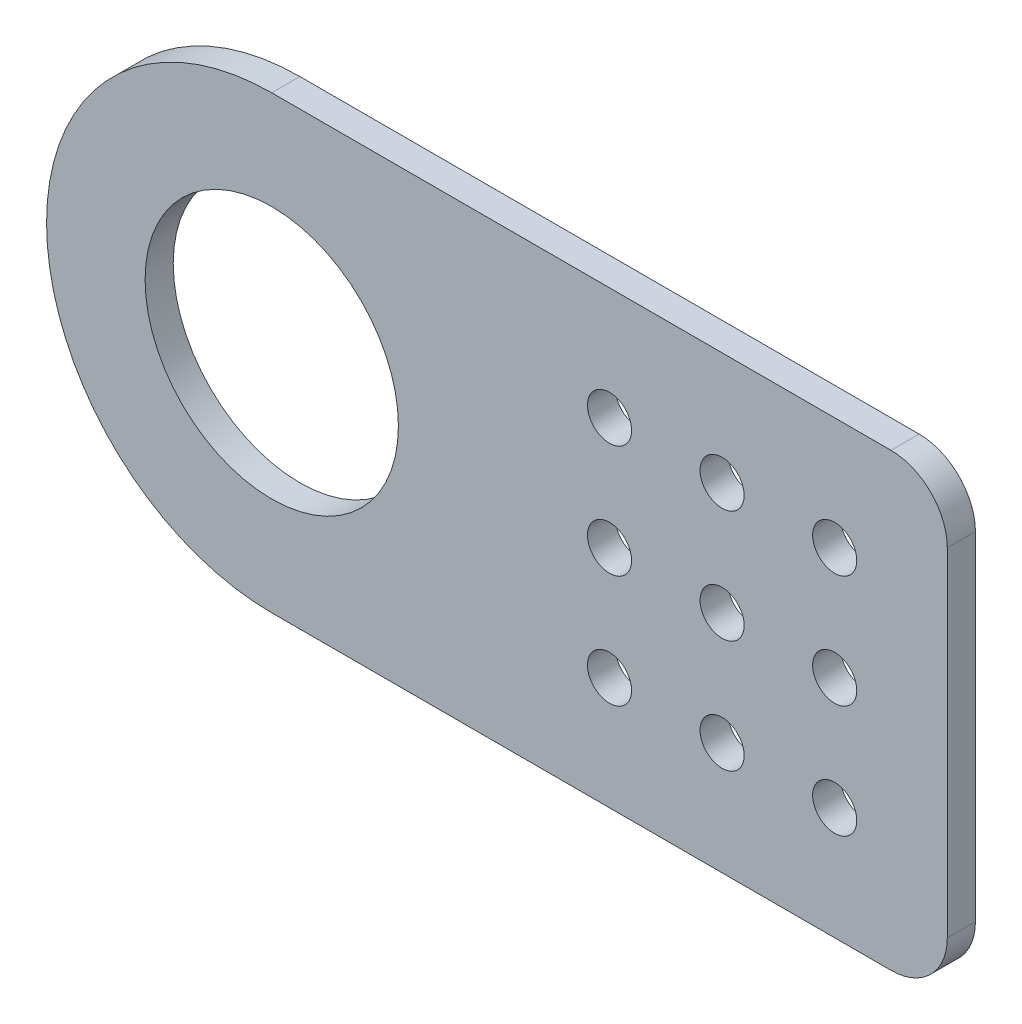
ISO-10303-21;
HEADER;
FILE_DESCRIPTION(('STEP AP214'),'2;1');
FILE_NAME('part.step','',(''),(''),'','','');
FILE_SCHEMA(('AUTOMOTIVE_DESIGN { 1 0 10303 214 1 1 1 1 }'));
ENDSEC;
DATA;
#1=APPLICATION_CONTEXT('core data for automotive mechanical design processes');
#2=APPLICATION_PROTOCOL_DEFINITION('international standard','automotive_design',2000,#1);
#3=PRODUCT_CONTEXT('',#1,'mechanical');
#4=PRODUCT('Part','Part','',(#3));
#5=PRODUCT_RELATED_PRODUCT_CATEGORY('part','',(#4));
#6=PRODUCT_DEFINITION_FORMATION('','',#4);
#7=PRODUCT_DEFINITION_CONTEXT('part definition',#1,'design');
#8=PRODUCT_DEFINITION('design','',#6,#7);
#9=PRODUCT_DEFINITION_SHAPE('','',#8);
#10=(LENGTH_UNIT() NAMED_UNIT(*) SI_UNIT(.MILLI.,.METRE.));
#11=(NAMED_UNIT(*) PLANE_ANGLE_UNIT() SI_UNIT($,.RADIAN.));
#12=(NAMED_UNIT(*) SI_UNIT($,.STERADIAN.) SOLID_ANGLE_UNIT());
#13=UNCERTAINTY_MEASURE_WITH_UNIT(LENGTH_MEASURE(1.E-05),#10,'distance_accuracy_value','');
#14=(GEOMETRIC_REPRESENTATION_CONTEXT(3) GLOBAL_UNCERTAINTY_ASSIGNED_CONTEXT((#13)) GLOBAL_UNIT_ASSIGNED_CONTEXT((#10,
#11,#12)) REPRESENTATION_CONTEXT('',''));
#15=CARTESIAN_POINT('',(0.,0.,0.));
#16=DIRECTION('',(0.,0.,1.));
#17=DIRECTION('',(1.,0.,0.));
#18=AXIS2_PLACEMENT_3D('',#15,#16,#17);
#19=CARTESIAN_POINT('',(0.,0.,0.));
#20=DIRECTION('',(0.,0.,1.));
#21=DIRECTION('',(1.,0.,0.));
#22=AXIS2_PLACEMENT_3D('',#19,#20,#21);
#23=PLANE('',#22);
#24=CARTESIAN_POINT('',(0.,0.,0.));
#25=DIRECTION('',(0.,0.,1.));
#26=DIRECTION('',(1.,0.,0.));
#27=AXIS2_PLACEMENT_3D('',#24,#25,#26);
#28=CIRCLE('',#27,14.2875);
#29=CARTESIAN_POINT('',(14.2875,0.,0.));
#30=VERTEX_POINT('',#29);
#31=EDGE_CURVE('E136',#30,#30,#28,.T.);
#32=ORIENTED_EDGE('',*,*,#31,.T.);
#33=EDGE_LOOP('',(#32));
#34=FACE_BOUND('',#33,.T.);
#35=CARTESIAN_POINT('',(63.5,-12.7,0.));
#36=DIRECTION('',(0.,0.,1.));
#37=DIRECTION('',(1.,0.,0.));
#38=AXIS2_PLACEMENT_3D('',#35,#36,#37);
#39=CIRCLE('',#38,2.4892);
#40=CARTESIAN_POINT('',(65.9892,-12.7,0.));
#41=VERTEX_POINT('',#40);
#42=EDGE_CURVE('E139',#41,#41,#39,.T.);
#43=ORIENTED_EDGE('',*,*,#42,.T.);
#44=EDGE_LOOP('',(#43));
#45=FACE_BOUND('',#44,.T.);
#46=CARTESIAN_POINT('',(38.1,-12.7,0.));
#47=DIRECTION('',(0.,0.,1.));
#48=DIRECTION('',(1.,0.,0.));
#49=AXIS2_PLACEMENT_3D('',#46,#47,#48);
#50=CIRCLE('',#49,2.4892);
#51=CARTESIAN_POINT('',(40.5892,-12.7,0.));
#52=VERTEX_POINT('',#51);
#53=EDGE_CURVE('E142',#52,#52,#50,.T.);
#54=ORIENTED_EDGE('',*,*,#53,.T.);
#55=EDGE_LOOP('',(#54));
#56=FACE_BOUND('',#55,.T.);
#57=CARTESIAN_POINT('',(50.8,0.,0.));
#58=DIRECTION('',(0.,0.,1.));
#59=DIRECTION('',(1.,0.,0.));
#60=AXIS2_PLACEMENT_3D('',#57,#58,#59);
#61=CIRCLE('',#60,2.4892);
#62=CARTESIAN_POINT('',(53.2892,0.,0.));
#63=VERTEX_POINT('',#62);
#64=EDGE_CURVE('E145',#63,#63,#61,.T.);
#65=ORIENTED_EDGE('',*,*,#64,.T.);
#66=EDGE_LOOP('',(#65));
#67=FACE_BOUND('',#66,.T.);
#68=CARTESIAN_POINT('',(63.5,12.7,0.));
#69=DIRECTION('',(0.,0.,1.));
#70=DIRECTION('',(1.,0.,0.));
#71=AXIS2_PLACEMENT_3D('',#68,#69,#70);
#72=CIRCLE('',#71,2.4892);
#73=CARTESIAN_POINT('',(65.9892,12.7,0.));
#74=VERTEX_POINT('',#73);
#75=EDGE_CURVE('E148',#74,#74,#72,.T.);
#76=ORIENTED_EDGE('',*,*,#75,.T.);
#77=EDGE_LOOP('',(#76));
#78=FACE_BOUND('',#77,.T.);
#79=CARTESIAN_POINT('',(38.1,12.7,0.));
#80=DIRECTION('',(0.,0.,1.));
#81=DIRECTION('',(1.,0.,0.));
#82=AXIS2_PLACEMENT_3D('',#79,#80,#81);
#83=CIRCLE('',#82,2.4892);
#84=CARTESIAN_POINT('',(40.5892,12.7,0.));
#85=VERTEX_POINT('',#84);
#86=EDGE_CURVE('E151',#85,#85,#83,.T.);
#87=ORIENTED_EDGE('',*,*,#86,.T.);
#88=EDGE_LOOP('',(#87));
#89=FACE_BOUND('',#88,.T.);
#90=CARTESIAN_POINT('',(50.8,12.7,0.));
#91=DIRECTION('',(0.,0.,1.));
#92=DIRECTION('',(1.,0.,0.));
#93=AXIS2_PLACEMENT_3D('',#90,#91,#92);
#94=CIRCLE('',#93,2.4892);
#95=CARTESIAN_POINT('',(53.2892,12.7,0.));
#96=VERTEX_POINT('',#95);
#97=EDGE_CURVE('E154',#96,#96,#94,.T.);
#98=ORIENTED_EDGE('',*,*,#97,.T.);
#99=EDGE_LOOP('',(#98));
#100=FACE_BOUND('',#99,.T.);
#101=CARTESIAN_POINT('',(63.5,0.,0.));
#102=DIRECTION('',(0.,0.,1.));
#103=DIRECTION('',(1.,0.,0.));
#104=AXIS2_PLACEMENT_3D('',#101,#102,#103);
#105=CIRCLE('',#104,2.4892);
#106=CARTESIAN_POINT('',(65.9892,0.,0.));
#107=VERTEX_POINT('',#106);
#108=EDGE_CURVE('E157',#107,#107,#105,.T.);
#109=ORIENTED_EDGE('',*,*,#108,.T.);
#110=EDGE_LOOP('',(#109));
#111=FACE_BOUND('',#110,.T.);
#112=CARTESIAN_POINT('',(38.1,0.,0.));
#113=DIRECTION('',(0.,0.,1.));
#114=DIRECTION('',(1.,0.,0.));
#115=AXIS2_PLACEMENT_3D('',#112,#113,#114);
#116=CIRCLE('',#115,2.4892);
#117=CARTESIAN_POINT('',(40.5892,0.,0.));
#118=VERTEX_POINT('',#117);
#119=EDGE_CURVE('E88',#118,#118,#116,.T.);
#120=ORIENTED_EDGE('',*,*,#119,.T.);
#121=EDGE_LOOP('',(#120));
#122=FACE_BOUND('',#121,.T.);
#123=CARTESIAN_POINT('',(50.8,-12.7,0.));
#124=DIRECTION('',(0.,0.,1.));
#125=DIRECTION('',(1.,0.,0.));
#126=AXIS2_PLACEMENT_3D('',#123,#124,#125);
#127=CIRCLE('',#126,2.4892);
#128=CARTESIAN_POINT('',(53.2892,-12.7,0.));
#129=VERTEX_POINT('',#128);
#130=EDGE_CURVE('E85',#129,#129,#127,.T.);
#131=ORIENTED_EDGE('',*,*,#130,.T.);
#132=EDGE_LOOP('',(#131));
#133=FACE_BOUND('',#132,.T.);
#134=DIRECTION('',(1.,0.,0.));
#135=VECTOR('',#134,1.);
#136=CARTESIAN_POINT('',(0.,-25.4,0.));
#137=LINE('',#136,#135);
#138=CARTESIAN_POINT('',(0.,-25.4,0.));
#139=VERTEX_POINT('',#138);
#140=CARTESIAN_POINT('',(69.85,-25.4,0.));
#141=VERTEX_POINT('',#140);
#142=EDGE_CURVE('E69',#139,#141,#137,.T.);
#143=ORIENTED_EDGE('',*,*,#142,.F.);
#144=CARTESIAN_POINT('',(0.,0.,0.));
#145=DIRECTION('',(0.,0.,1.));
#146=DIRECTION('',(1.,0.,0.));
#147=AXIS2_PLACEMENT_3D('',#144,#145,#146);
#148=CIRCLE('',#147,25.4);
#149=CARTESIAN_POINT('',(0.,25.4,0.));
#150=VERTEX_POINT('',#149);
#151=EDGE_CURVE('E82',#150,#139,#148,.T.);
#152=ORIENTED_EDGE('',*,*,#151,.F.);
#153=DIRECTION('',(1.,0.,0.));
#154=VECTOR('',#153,1.);
#155=CARTESIAN_POINT('',(76.2,25.4,0.));
#156=LINE('',#155,#154);
#157=CARTESIAN_POINT('',(69.85,25.4,0.));
#158=VERTEX_POINT('',#157);
#159=EDGE_CURVE('E94',#158,#150,#156,.F.);
#160=ORIENTED_EDGE('',*,*,#159,.F.);
#161=CARTESIAN_POINT('',(69.85,19.05,0.));
#162=DIRECTION('',(0.,0.,1.));
#163=DIRECTION('',(1.,0.,0.));
#164=AXIS2_PLACEMENT_3D('',#161,#162,#163);
#165=CIRCLE('',#164,6.35);
#166=CARTESIAN_POINT('',(76.2,19.05,0.));
#167=VERTEX_POINT('',#166);
#168=EDGE_CURVE('E162',#167,#158,#165,.T.);
#169=ORIENTED_EDGE('',*,*,#168,.F.);
#170=DIRECTION('',(0.,1.,0.));
#171=VECTOR('',#170,1.);
#172=CARTESIAN_POINT('',(76.2,-25.4,0.));
#173=LINE('',#172,#171);
#174=CARTESIAN_POINT('',(76.2,-19.05,0.));
#175=VERTEX_POINT('',#174);
#176=EDGE_CURVE('E71',#175,#167,#173,.T.);
#177=ORIENTED_EDGE('',*,*,#176,.F.);
#178=CARTESIAN_POINT('',(69.85,-19.05,0.));
#179=DIRECTION('',(0.,0.,1.));
#180=DIRECTION('',(1.,0.,0.));
#181=AXIS2_PLACEMENT_3D('',#178,#179,#180);
#182=CIRCLE('',#181,6.35);
#183=EDGE_CURVE('E18',#141,#175,#182,.T.);
#184=ORIENTED_EDGE('',*,*,#183,.F.);
#185=EDGE_LOOP('',(#143,#152,#160,#169,#177,#184));
#186=FACE_BOUND('',#185,.T.);
#187=ADVANCED_FACE('F15',(#34,#45,#56,#67,#78,#89,#100,#111,#122,#133,#186),#23,.F.);
#188=CARTESIAN_POINT('',(69.85,-19.05,0.));
#189=DIRECTION('',(0.,0.,1.));
#190=DIRECTION('',(1.,0.,0.));
#191=AXIS2_PLACEMENT_3D('',#188,#189,#190);
#192=CYLINDRICAL_SURFACE('',#191,6.35);
#193=ORIENTED_EDGE('',*,*,#183,.T.);
#194=DIRECTION('',(0.,0.,-1.));
#195=VECTOR('',#194,1.);
#196=CARTESIAN_POINT('',(76.2,-19.05,0.));
#197=LINE('',#196,#195);
#198=CARTESIAN_POINT('',(76.2,-19.05,3.175));
#199=VERTEX_POINT('',#198);
#200=EDGE_CURVE('E74',#199,#175,#197,.T.);
#201=ORIENTED_EDGE('',*,*,#200,.F.);
#202=CARTESIAN_POINT('',(69.85,-19.05,3.175));
#203=DIRECTION('',(0.,0.,1.));
#204=DIRECTION('',(1.,0.,0.));
#205=AXIS2_PLACEMENT_3D('',#202,#203,#204);
#206=CIRCLE('',#205,6.35);
#207=CARTESIAN_POINT('',(69.85,-25.4,3.175));
#208=VERTEX_POINT('',#207);
#209=EDGE_CURVE('E79',#208,#199,#206,.T.);
#210=ORIENTED_EDGE('',*,*,#209,.F.);
#211=DIRECTION('',(0.,0.,-1.));
#212=VECTOR('',#211,1.);
#213=CARTESIAN_POINT('',(69.85,-25.4,0.));
#214=LINE('',#213,#212);
#215=EDGE_CURVE('E76',#141,#208,#214,.F.);
#216=ORIENTED_EDGE('',*,*,#215,.F.);
#217=EDGE_LOOP('',(#193,#201,#210,#216));
#218=FACE_BOUND('',#217,.T.);
#219=ADVANCED_FACE('F77',(#218),#192,.T.);
#220=CARTESIAN_POINT('',(76.2,-25.4,0.));
#221=DIRECTION('',(1.,0.,0.));
#222=DIRECTION('',(0.,0.,-1.));
#223=AXIS2_PLACEMENT_3D('',#220,#221,#222);
#224=PLANE('',#223);
#225=DIRECTION('',(0.,0.,1.));
#226=VECTOR('',#225,1.);
#227=CARTESIAN_POINT('',(76.2,19.05,0.));
#228=LINE('',#227,#226);
#229=CARTESIAN_POINT('',(76.2,19.05,3.175));
#230=VERTEX_POINT('',#229);
#231=EDGE_CURVE('E98',#230,#167,#228,.F.);
#232=ORIENTED_EDGE('',*,*,#231,.F.);
#233=DIRECTION('',(0.,1.,0.));
#234=VECTOR('',#233,1.);
#235=CARTESIAN_POINT('',(76.2,0.,3.175));
#236=LINE('',#235,#234);
#237=EDGE_CURVE('E134',#199,#230,#236,.T.);
#238=ORIENTED_EDGE('',*,*,#237,.F.);
#239=ORIENTED_EDGE('',*,*,#200,.T.);
#240=ORIENTED_EDGE('',*,*,#176,.T.);
#241=EDGE_LOOP('',(#232,#238,#239,#240));
#242=FACE_BOUND('',#241,.T.);
#243=ADVANCED_FACE('F185',(#242),#224,.T.);
#244=CARTESIAN_POINT('',(69.85,19.05,0.));
#245=DIRECTION('',(0.,0.,1.));
#246=DIRECTION('',(1.,0.,0.));
#247=AXIS2_PLACEMENT_3D('',#244,#245,#246);
#248=CYLINDRICAL_SURFACE('',#247,6.35);
#249=ORIENTED_EDGE('',*,*,#168,.T.);
#250=DIRECTION('',(0.,0.,1.));
#251=VECTOR('',#250,1.);
#252=CARTESIAN_POINT('',(69.85,25.4,0.));
#253=LINE('',#252,#251);
#254=CARTESIAN_POINT('',(69.85,25.4,3.175));
#255=VERTEX_POINT('',#254);
#256=EDGE_CURVE('E97',#255,#158,#253,.F.);
#257=ORIENTED_EDGE('',*,*,#256,.F.);
#258=CARTESIAN_POINT('',(69.85,19.05,3.175));
#259=DIRECTION('',(0.,0.,1.));
#260=DIRECTION('',(1.,0.,0.));
#261=AXIS2_PLACEMENT_3D('',#258,#259,#260);
#262=CIRCLE('',#261,6.35);
#263=EDGE_CURVE('E131',#230,#255,#262,.T.);
#264=ORIENTED_EDGE('',*,*,#263,.F.);
#265=ORIENTED_EDGE('',*,*,#231,.T.);
#266=EDGE_LOOP('',(#249,#257,#264,#265));
#267=FACE_BOUND('',#266,.T.);
#268=ADVANCED_FACE('F182',(#267),#248,.T.);
#269=CARTESIAN_POINT('',(76.2,25.4,0.));
#270=DIRECTION('',(0.,1.,0.));
#271=DIRECTION('',(0.,0.,1.));
#272=AXIS2_PLACEMENT_3D('',#269,#270,#271);
#273=PLANE('',#272);
#274=DIRECTION('',(0.,0.,1.));
#275=VECTOR('',#274,1.);
#276=CARTESIAN_POINT('',(0.,25.4,0.));
#277=LINE('',#276,#275);
#278=CARTESIAN_POINT('',(0.,25.4,3.175));
#279=VERTEX_POINT('',#278);
#280=EDGE_CURVE('E96',#279,#150,#277,.F.);
#281=ORIENTED_EDGE('',*,*,#280,.F.);
#282=DIRECTION('',(1.,0.,0.));
#283=VECTOR('',#282,1.);
#284=CARTESIAN_POINT('',(0.,25.4,3.175));
#285=LINE('',#284,#283);
#286=EDGE_CURVE('E130',#255,#279,#285,.F.);
#287=ORIENTED_EDGE('',*,*,#286,.F.);
#288=ORIENTED_EDGE('',*,*,#256,.T.);
#289=ORIENTED_EDGE('',*,*,#159,.T.);
#290=EDGE_LOOP('',(#281,#287,#288,#289));
#291=FACE_BOUND('',#290,.T.);
#292=ADVANCED_FACE('F181',(#291),#273,.T.);
#293=CARTESIAN_POINT('',(0.,0.,0.));
#294=DIRECTION('',(0.,0.,1.));
#295=DIRECTION('',(1.,0.,0.));
#296=AXIS2_PLACEMENT_3D('',#293,#294,#295);
#297=CYLINDRICAL_SURFACE('',#296,25.4);
#298=DIRECTION('',(0.,0.,-1.));
#299=VECTOR('',#298,1.);
#300=CARTESIAN_POINT('',(0.,-25.4,0.));
#301=LINE('',#300,#299);
#302=CARTESIAN_POINT('',(0.,-25.4,3.175));
#303=VERTEX_POINT('',#302);
#304=EDGE_CURVE('E33',#303,#139,#301,.T.);
#305=ORIENTED_EDGE('',*,*,#304,.F.);
#306=CARTESIAN_POINT('',(0.,0.,3.175));
#307=DIRECTION('',(0.,0.,1.));
#308=DIRECTION('',(1.,0.,0.));
#309=AXIS2_PLACEMENT_3D('',#306,#307,#308);
#310=CIRCLE('',#309,25.4);
#311=EDGE_CURVE('E127',#279,#303,#310,.T.);
#312=ORIENTED_EDGE('',*,*,#311,.F.);
#313=ORIENTED_EDGE('',*,*,#280,.T.);
#314=ORIENTED_EDGE('',*,*,#151,.T.);
#315=EDGE_LOOP('',(#305,#312,#313,#314));
#316=FACE_BOUND('',#315,.T.);
#317=ADVANCED_FACE('F179',(#316),#297,.T.);
#318=CARTESIAN_POINT('',(0.,-25.4,0.));
#319=DIRECTION('',(0.,-1.,0.));
#320=DIRECTION('',(0.,0.,-1.));
#321=AXIS2_PLACEMENT_3D('',#318,#319,#320);
#322=PLANE('',#321);
#323=ORIENTED_EDGE('',*,*,#304,.T.);
#324=ORIENTED_EDGE('',*,*,#142,.T.);
#325=ORIENTED_EDGE('',*,*,#215,.T.);
#326=DIRECTION('',(1.,0.,0.));
#327=VECTOR('',#326,1.);
#328=CARTESIAN_POINT('',(0.,-25.4,3.175));
#329=LINE('',#328,#327);
#330=EDGE_CURVE('E126',#303,#208,#329,.T.);
#331=ORIENTED_EDGE('',*,*,#330,.F.);
#332=EDGE_LOOP('',(#323,#324,#325,#331));
#333=FACE_BOUND('',#332,.T.);
#334=ADVANCED_FACE('F84',(#333),#322,.T.);
#335=CARTESIAN_POINT('',(50.8,-12.7,113.6366165679));
#336=DIRECTION('',(0.,0.,1.));
#337=DIRECTION('',(1.,0.,0.));
#338=AXIS2_PLACEMENT_3D('',#335,#336,#337);
#339=CYLINDRICAL_SURFACE('',#338,2.4892);
#340=ORIENTED_EDGE('',*,*,#130,.F.);
#341=EDGE_LOOP('',(#340));
#342=FACE_BOUND('',#341,.T.);
#343=CARTESIAN_POINT('',(50.8,-12.7,3.175));
#344=DIRECTION('',(0.,0.,1.));
#345=DIRECTION('',(1.,0.,0.));
#346=AXIS2_PLACEMENT_3D('',#343,#344,#345);
#347=CIRCLE('',#346,2.4892);
#348=CARTESIAN_POINT('',(53.2892,-12.7,3.175));
#349=VERTEX_POINT('',#348);
#350=EDGE_CURVE('E123',#349,#349,#347,.F.);
#351=ORIENTED_EDGE('',*,*,#350,.F.);
#352=EDGE_LOOP('',(#351));
#353=FACE_BOUND('',#352,.T.);
#354=ADVANCED_FACE('F236',(#342,#353),#339,.F.);
#355=CARTESIAN_POINT('',(38.1,0.,113.6366165679));
#356=DIRECTION('',(0.,0.,1.));
#357=DIRECTION('',(1.,0.,0.));
#358=AXIS2_PLACEMENT_3D('',#355,#356,#357);
#359=CYLINDRICAL_SURFACE('',#358,2.4892);
#360=ORIENTED_EDGE('',*,*,#119,.F.);
#361=EDGE_LOOP('',(#360));
#362=FACE_BOUND('',#361,.T.);
#363=CARTESIAN_POINT('',(38.1,0.,3.175));
#364=DIRECTION('',(0.,0.,1.));
#365=DIRECTION('',(1.,0.,0.));
#366=AXIS2_PLACEMENT_3D('',#363,#364,#365);
#367=CIRCLE('',#366,2.4892);
#368=CARTESIAN_POINT('',(40.5892,0.,3.175));
#369=VERTEX_POINT('',#368);
#370=EDGE_CURVE('E120',#369,#369,#367,.F.);
#371=ORIENTED_EDGE('',*,*,#370,.F.);
#372=EDGE_LOOP('',(#371));
#373=FACE_BOUND('',#372,.T.);
#374=ADVANCED_FACE('F232',(#362,#373),#359,.F.);
#375=CARTESIAN_POINT('',(63.5,0.,113.6366165679));
#376=DIRECTION('',(0.,0.,1.));
#377=DIRECTION('',(1.,0.,0.));
#378=AXIS2_PLACEMENT_3D('',#375,#376,#377);
#379=CYLINDRICAL_SURFACE('',#378,2.4892);
#380=ORIENTED_EDGE('',*,*,#108,.F.);
#381=EDGE_LOOP('',(#380));
#382=FACE_BOUND('',#381,.T.);
#383=CARTESIAN_POINT('',(63.5,0.,3.175));
#384=DIRECTION('',(0.,0.,1.));
#385=DIRECTION('',(1.,0.,0.));
#386=AXIS2_PLACEMENT_3D('',#383,#384,#385);
#387=CIRCLE('',#386,2.4892);
#388=CARTESIAN_POINT('',(65.9892,0.,3.175));
#389=VERTEX_POINT('',#388);
#390=EDGE_CURVE('E117',#389,#389,#387,.F.);
#391=ORIENTED_EDGE('',*,*,#390,.F.);
#392=EDGE_LOOP('',(#391));
#393=FACE_BOUND('',#392,.T.);
#394=ADVANCED_FACE('F228',(#382,#393),#379,.F.);
#395=CARTESIAN_POINT('',(50.8,12.7,113.6366165679));
#396=DIRECTION('',(0.,0.,1.));
#397=DIRECTION('',(1.,0.,0.));
#398=AXIS2_PLACEMENT_3D('',#395,#396,#397);
#399=CYLINDRICAL_SURFACE('',#398,2.4892);
#400=ORIENTED_EDGE('',*,*,#97,.F.);
#401=EDGE_LOOP('',(#400));
#402=FACE_BOUND('',#401,.T.);
#403=CARTESIAN_POINT('',(50.8,12.7,3.175));
#404=DIRECTION('',(0.,0.,1.));
#405=DIRECTION('',(1.,0.,0.));
#406=AXIS2_PLACEMENT_3D('',#403,#404,#405);
#407=CIRCLE('',#406,2.4892);
#408=CARTESIAN_POINT('',(53.2892,12.7,3.175));
#409=VERTEX_POINT('',#408);
#410=EDGE_CURVE('E114',#409,#409,#407,.F.);
#411=ORIENTED_EDGE('',*,*,#410,.F.);
#412=EDGE_LOOP('',(#411));
#413=FACE_BOUND('',#412,.T.);
#414=ADVANCED_FACE('F224',(#402,#413),#399,.F.);
#415=CARTESIAN_POINT('',(38.1,12.7,113.6366165679));
#416=DIRECTION('',(0.,0.,1.));
#417=DIRECTION('',(1.,0.,0.));
#418=AXIS2_PLACEMENT_3D('',#415,#416,#417);
#419=CYLINDRICAL_SURFACE('',#418,2.4892);
#420=ORIENTED_EDGE('',*,*,#86,.F.);
#421=EDGE_LOOP('',(#420));
#422=FACE_BOUND('',#421,.T.);
#423=CARTESIAN_POINT('',(38.1,12.7,3.175));
#424=DIRECTION('',(0.,0.,1.));
#425=DIRECTION('',(1.,0.,0.));
#426=AXIS2_PLACEMENT_3D('',#423,#424,#425);
#427=CIRCLE('',#426,2.4892);
#428=CARTESIAN_POINT('',(40.5892,12.7,3.175));
#429=VERTEX_POINT('',#428);
#430=EDGE_CURVE('E111',#429,#429,#427,.F.);
#431=ORIENTED_EDGE('',*,*,#430,.F.);
#432=EDGE_LOOP('',(#431));
#433=FACE_BOUND('',#432,.T.);
#434=ADVANCED_FACE('F220',(#422,#433),#419,.F.);
#435=CARTESIAN_POINT('',(63.5,12.7,113.6366165679));
#436=DIRECTION('',(0.,0.,1.));
#437=DIRECTION('',(1.,0.,0.));
#438=AXIS2_PLACEMENT_3D('',#435,#436,#437);
#439=CYLINDRICAL_SURFACE('',#438,2.4892);
#440=ORIENTED_EDGE('',*,*,#75,.F.);
#441=EDGE_LOOP('',(#440));
#442=FACE_BOUND('',#441,.T.);
#443=CARTESIAN_POINT('',(63.5,12.7,3.175));
#444=DIRECTION('',(0.,0.,1.));
#445=DIRECTION('',(1.,0.,0.));
#446=AXIS2_PLACEMENT_3D('',#443,#444,#445);
#447=CIRCLE('',#446,2.4892);
#448=CARTESIAN_POINT('',(65.9892,12.7,3.175));
#449=VERTEX_POINT('',#448);
#450=EDGE_CURVE('E108',#449,#449,#447,.F.);
#451=ORIENTED_EDGE('',*,*,#450,.F.);
#452=EDGE_LOOP('',(#451));
#453=FACE_BOUND('',#452,.T.);
#454=ADVANCED_FACE('F216',(#442,#453),#439,.F.);
#455=CARTESIAN_POINT('',(50.8,0.,113.6366165679));
#456=DIRECTION('',(0.,0.,1.));
#457=DIRECTION('',(1.,0.,0.));
#458=AXIS2_PLACEMENT_3D('',#455,#456,#457);
#459=CYLINDRICAL_SURFACE('',#458,2.4892);
#460=ORIENTED_EDGE('',*,*,#64,.F.);
#461=EDGE_LOOP('',(#460));
#462=FACE_BOUND('',#461,.T.);
#463=CARTESIAN_POINT('',(50.8,0.,3.175));
#464=DIRECTION('',(0.,0.,1.));
#465=DIRECTION('',(1.,0.,0.));
#466=AXIS2_PLACEMENT_3D('',#463,#464,#465);
#467=CIRCLE('',#466,2.4892);
#468=CARTESIAN_POINT('',(53.2892,0.,3.175));
#469=VERTEX_POINT('',#468);
#470=EDGE_CURVE('E105',#469,#469,#467,.F.);
#471=ORIENTED_EDGE('',*,*,#470,.F.);
#472=EDGE_LOOP('',(#471));
#473=FACE_BOUND('',#472,.T.);
#474=ADVANCED_FACE('F212',(#462,#473),#459,.F.);
#475=CARTESIAN_POINT('',(38.1,-12.7,113.6366165679));
#476=DIRECTION('',(0.,0.,1.));
#477=DIRECTION('',(1.,0.,0.));
#478=AXIS2_PLACEMENT_3D('',#475,#476,#477);
#479=CYLINDRICAL_SURFACE('',#478,2.4892);
#480=ORIENTED_EDGE('',*,*,#53,.F.);
#481=EDGE_LOOP('',(#480));
#482=FACE_BOUND('',#481,.T.);
#483=CARTESIAN_POINT('',(38.1,-12.7,3.175));
#484=DIRECTION('',(0.,0.,1.));
#485=DIRECTION('',(1.,0.,0.));
#486=AXIS2_PLACEMENT_3D('',#483,#484,#485);
#487=CIRCLE('',#486,2.4892);
#488=CARTESIAN_POINT('',(40.5892,-12.7,3.175));
#489=VERTEX_POINT('',#488);
#490=EDGE_CURVE('E102',#489,#489,#487,.F.);
#491=ORIENTED_EDGE('',*,*,#490,.F.);
#492=EDGE_LOOP('',(#491));
#493=FACE_BOUND('',#492,.T.);
#494=ADVANCED_FACE('F208',(#482,#493),#479,.F.);
#495=CARTESIAN_POINT('',(63.5,-12.7,113.6366165679));
#496=DIRECTION('',(0.,0.,1.));
#497=DIRECTION('',(1.,0.,0.));
#498=AXIS2_PLACEMENT_3D('',#495,#496,#497);
#499=CYLINDRICAL_SURFACE('',#498,2.4892);
#500=ORIENTED_EDGE('',*,*,#42,.F.);
#501=EDGE_LOOP('',(#500));
#502=FACE_BOUND('',#501,.T.);
#503=CARTESIAN_POINT('',(63.5,-12.7,3.175));
#504=DIRECTION('',(0.,0.,1.));
#505=DIRECTION('',(1.,0.,0.));
#506=AXIS2_PLACEMENT_3D('',#503,#504,#505);
#507=CIRCLE('',#506,2.4892);
#508=CARTESIAN_POINT('',(65.9892,-12.7,3.175));
#509=VERTEX_POINT('',#508);
#510=EDGE_CURVE('E24',#509,#509,#507,.F.);
#511=ORIENTED_EDGE('',*,*,#510,.F.);
#512=EDGE_LOOP('',(#511));
#513=FACE_BOUND('',#512,.T.);
#514=ADVANCED_FACE('F201',(#502,#513),#499,.F.);
#515=CARTESIAN_POINT('',(0.,0.,0.));
#516=DIRECTION('',(0.,0.,1.));
#517=DIRECTION('',(1.,0.,0.));
#518=AXIS2_PLACEMENT_3D('',#515,#516,#517);
#519=CYLINDRICAL_SURFACE('',#518,14.2875);
#520=ORIENTED_EDGE('',*,*,#31,.F.);
#521=EDGE_LOOP('',(#520));
#522=FACE_BOUND('',#521,.T.);
#523=CARTESIAN_POINT('',(0.,0.,3.175));
#524=DIRECTION('',(0.,0.,1.));
#525=DIRECTION('',(1.,0.,0.));
#526=AXIS2_PLACEMENT_3D('',#523,#524,#525);
#527=CIRCLE('',#526,14.2875);
#528=CARTESIAN_POINT('',(14.2875,0.,3.175));
#529=VERTEX_POINT('',#528);
#530=EDGE_CURVE('E9',#529,#529,#527,.F.);
#531=ORIENTED_EDGE('',*,*,#530,.F.);
#532=EDGE_LOOP('',(#531));
#533=FACE_BOUND('',#532,.T.);
#534=ADVANCED_FACE('F195',(#522,#533),#519,.F.);
#535=CARTESIAN_POINT('',(0.,0.,3.175));
#536=DIRECTION('',(0.,0.,1.));
#537=DIRECTION('',(1.,0.,0.));
#538=AXIS2_PLACEMENT_3D('',#535,#536,#537);
#539=PLANE('',#538);
#540=ORIENTED_EDGE('',*,*,#530,.T.);
#541=EDGE_LOOP('',(#540));
#542=FACE_BOUND('',#541,.T.);
#543=ORIENTED_EDGE('',*,*,#510,.T.);
#544=EDGE_LOOP('',(#543));
#545=FACE_BOUND('',#544,.T.);
#546=ORIENTED_EDGE('',*,*,#490,.T.);
#547=EDGE_LOOP('',(#546));
#548=FACE_BOUND('',#547,.T.);
#549=ORIENTED_EDGE('',*,*,#470,.T.);
#550=EDGE_LOOP('',(#549));
#551=FACE_BOUND('',#550,.T.);
#552=ORIENTED_EDGE('',*,*,#450,.T.);
#553=EDGE_LOOP('',(#552));
#554=FACE_BOUND('',#553,.T.);
#555=ORIENTED_EDGE('',*,*,#430,.T.);
#556=EDGE_LOOP('',(#555));
#557=FACE_BOUND('',#556,.T.);
#558=ORIENTED_EDGE('',*,*,#410,.T.);
#559=EDGE_LOOP('',(#558));
#560=FACE_BOUND('',#559,.T.);
#561=ORIENTED_EDGE('',*,*,#390,.T.);
#562=EDGE_LOOP('',(#561));
#563=FACE_BOUND('',#562,.T.);
#564=ORIENTED_EDGE('',*,*,#370,.T.);
#565=EDGE_LOOP('',(#564));
#566=FACE_BOUND('',#565,.T.);
#567=ORIENTED_EDGE('',*,*,#350,.T.);
#568=EDGE_LOOP('',(#567));
#569=FACE_BOUND('',#568,.T.);
#570=ORIENTED_EDGE('',*,*,#311,.T.);
#571=ORIENTED_EDGE('',*,*,#330,.T.);
#572=ORIENTED_EDGE('',*,*,#209,.T.);
#573=ORIENTED_EDGE('',*,*,#237,.T.);
#574=ORIENTED_EDGE('',*,*,#263,.T.);
#575=ORIENTED_EDGE('',*,*,#286,.T.);
#576=EDGE_LOOP('',(#570,#571,#572,#573,#574,#575));
#577=FACE_BOUND('',#576,.T.);
#578=ADVANCED_FACE('F177',(#542,#545,#548,#551,#554,#557,#560,#563,#566,#569,#577),#539,.T.);
#579=CLOSED_SHELL('',(#187,#219,#243,#268,#292,#317,#334,#354,#374,#394,#414,#434,#454,#474,
#494,#514,#534,#578));
#580=MANIFOLD_SOLID_BREP('B1',#579);
#581=ADVANCED_BREP_SHAPE_REPRESENTATION('',(#18,#580),#14);
#582=SHAPE_DEFINITION_REPRESENTATION(#9,#581);
ENDSEC;
END-ISO-10303-21;
